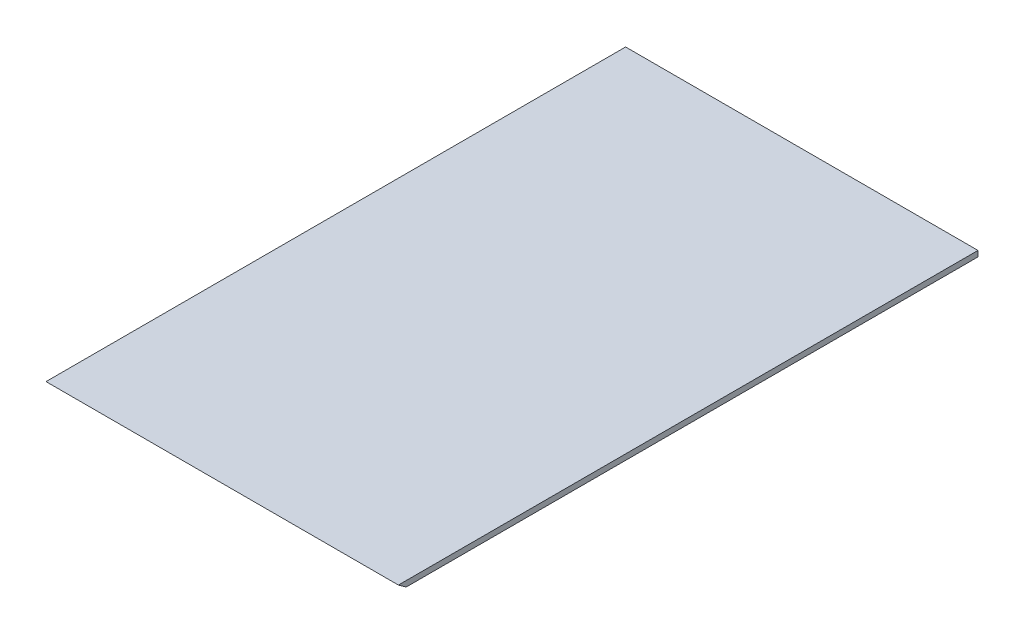
ISO-10303-21;
HEADER;
FILE_DESCRIPTION(('STEP AP214'),'2;1');
FILE_NAME('part.step','',(''),(''),'','','');
FILE_SCHEMA(('AUTOMOTIVE_DESIGN { 1 0 10303 214 1 1 1 1 }'));
ENDSEC;
DATA;
#1=APPLICATION_CONTEXT('core data for automotive mechanical design processes');
#2=APPLICATION_PROTOCOL_DEFINITION('international standard','automotive_design',2000,#1);
#3=PRODUCT_CONTEXT('',#1,'mechanical');
#4=PRODUCT('Part','Part','',(#3));
#5=PRODUCT_RELATED_PRODUCT_CATEGORY('part','',(#4));
#6=PRODUCT_DEFINITION_FORMATION('','',#4);
#7=PRODUCT_DEFINITION_CONTEXT('part definition',#1,'design');
#8=PRODUCT_DEFINITION('design','',#6,#7);
#9=PRODUCT_DEFINITION_SHAPE('','',#8);
#10=(LENGTH_UNIT() NAMED_UNIT(*) SI_UNIT(.MILLI.,.METRE.));
#11=(NAMED_UNIT(*) PLANE_ANGLE_UNIT() SI_UNIT($,.RADIAN.));
#12=(NAMED_UNIT(*) SI_UNIT($,.STERADIAN.) SOLID_ANGLE_UNIT());
#13=UNCERTAINTY_MEASURE_WITH_UNIT(LENGTH_MEASURE(1.E-05),#10,'distance_accuracy_value','');
#14=(GEOMETRIC_REPRESENTATION_CONTEXT(3) GLOBAL_UNCERTAINTY_ASSIGNED_CONTEXT((#13)) GLOBAL_UNIT_ASSIGNED_CONTEXT((#10,
#11,#12)) REPRESENTATION_CONTEXT('',''));
#15=CARTESIAN_POINT('',(0.,0.,0.));
#16=DIRECTION('',(0.,0.,1.));
#17=DIRECTION('',(1.,0.,0.));
#18=AXIS2_PLACEMENT_3D('',#15,#16,#17);
#19=CARTESIAN_POINT('',(0.,0.,331.679162275034));
#20=DIRECTION('',(0.,0.,-1.));
#21=DIRECTION('',(-1.,0.,0.));
#22=AXIS2_PLACEMENT_3D('',#19,#20,#21);
#23=PLANE('',#22);
#24=DIRECTION('',(0.,1.,0.));
#25=VECTOR('',#24,1.);
#26=CARTESIAN_POINT('',(119.32984659125,261.845661589939,331.679162275034));
#27=LINE('',#26,#25);
#28=CARTESIAN_POINT('',(119.32984659125,258.84566158994,331.679162275034));
#29=VERTEX_POINT('',#28);
#30=CARTESIAN_POINT('',(119.32984659125,261.845661589939,331.679162275034));
#31=VERTEX_POINT('',#30);
#32=EDGE_CURVE('E83',#29,#31,#27,.T.);
#33=ORIENTED_EDGE('',*,*,#32,.F.);
#34=DIRECTION('',(1.,0.,0.));
#35=VECTOR('',#34,1.);
#36=CARTESIAN_POINT('',(119.32984659125,258.84566158994,331.679162275034));
#37=LINE('',#36,#35);
#38=CARTESIAN_POINT('',(-68.1701534087503,258.84566158994,331.679162275034));
#39=VERTEX_POINT('',#38);
#40=EDGE_CURVE('E94',#39,#29,#37,.T.);
#41=ORIENTED_EDGE('',*,*,#40,.F.);
#42=DIRECTION('',(0.,-1.,0.));
#43=VECTOR('',#42,1.);
#44=CARTESIAN_POINT('',(-68.1701534087503,261.845661589939,331.679162275034));
#45=LINE('',#44,#43);
#46=CARTESIAN_POINT('',(-68.1701534087503,261.845661589939,331.679162275034));
#47=VERTEX_POINT('',#46);
#48=EDGE_CURVE('E85',#47,#39,#45,.T.);
#49=ORIENTED_EDGE('',*,*,#48,.F.);
#50=DIRECTION('',(-1.,0.,0.));
#51=VECTOR('',#50,1.);
#52=CARTESIAN_POINT('',(119.32984659125,261.845661589939,331.679162275034));
#53=LINE('',#52,#51);
#54=EDGE_CURVE('E75',#31,#47,#53,.T.);
#55=ORIENTED_EDGE('',*,*,#54,.F.);
#56=EDGE_LOOP('',(#33,#41,#49,#55));
#57=FACE_BOUND('',#56,.T.);
#58=ADVANCED_FACE('F33',(#57),#23,.T.);
#59=CARTESIAN_POINT('',(119.32984659125,258.84566158994,892.36319217791));
#60=DIRECTION('',(0.,1.,0.));
#61=DIRECTION('',(0.,0.,1.));
#62=AXIS2_PLACEMENT_3D('',#59,#60,#61);
#63=PLANE('',#62);
#64=DIRECTION('',(0.,0.,-1.));
#65=VECTOR('',#64,1.);
#66=CARTESIAN_POINT('',(119.32984659125,258.84566158994,892.36319217791));
#67=LINE('',#66,#65);
#68=CARTESIAN_POINT('',(119.32984659125,258.84566158994,635.901725400392));
#69=VERTEX_POINT('',#68);
#70=EDGE_CURVE('E88',#69,#29,#67,.T.);
#71=ORIENTED_EDGE('',*,*,#70,.F.);
#72=DIRECTION('',(-1.,0.,0.));
#73=VECTOR('',#72,1.);
#74=CARTESIAN_POINT('',(119.32984659125,258.84566158994,635.901725400392));
#75=LINE('',#74,#73);
#76=CARTESIAN_POINT('',(-68.1701534087503,258.84566158994,635.901725400392));
#77=VERTEX_POINT('',#76);
#78=EDGE_CURVE('E37',#69,#77,#75,.T.);
#79=ORIENTED_EDGE('',*,*,#78,.T.);
#80=DIRECTION('',(0.,0.,-1.));
#81=VECTOR('',#80,1.);
#82=CARTESIAN_POINT('',(-68.1701534087503,258.84566158994,892.36319217791));
#83=LINE('',#82,#81);
#84=EDGE_CURVE('E97',#77,#39,#83,.T.);
#85=ORIENTED_EDGE('',*,*,#84,.T.);
#86=ORIENTED_EDGE('',*,*,#40,.T.);
#87=EDGE_LOOP('',(#71,#79,#85,#86));
#88=FACE_BOUND('',#87,.T.);
#89=ADVANCED_FACE('F106',(#88),#63,.F.);
#90=CARTESIAN_POINT('',(-68.1701534087503,261.845661589939,892.36319217791));
#91=DIRECTION('',(1.,0.,0.));
#92=DIRECTION('',(0.,0.,-1.));
#93=AXIS2_PLACEMENT_3D('',#90,#91,#92);
#94=PLANE('',#93);
#95=ORIENTED_EDGE('',*,*,#84,.F.);
#96=DIRECTION('',(0.,0.583774943754806,0.811915522110566));
#97=VECTOR('',#96,1.);
#98=CARTESIAN_POINT('',(-68.1701534087503,381.424605486614,806.384799911092));
#99=LINE('',#98,#97);
#100=CARTESIAN_POINT('',(-68.1701534087503,261.845661589939,640.074132236946));
#101=VERTEX_POINT('',#100);
#102=EDGE_CURVE('E103',#77,#101,#99,.T.);
#103=ORIENTED_EDGE('',*,*,#102,.T.);
#104=DIRECTION('',(0.,0.,-1.));
#105=VECTOR('',#104,1.);
#106=CARTESIAN_POINT('',(-68.1701534087503,261.845661589939,892.36319217791));
#107=LINE('',#106,#105);
#108=EDGE_CURVE('E79',#101,#47,#107,.T.);
#109=ORIENTED_EDGE('',*,*,#108,.T.);
#110=ORIENTED_EDGE('',*,*,#48,.T.);
#111=EDGE_LOOP('',(#95,#103,#109,#110));
#112=FACE_BOUND('',#111,.T.);
#113=ADVANCED_FACE('F102',(#112),#94,.F.);
#114=CARTESIAN_POINT('',(119.32984659125,261.845661589939,892.36319217791));
#115=DIRECTION('',(0.,-1.,0.));
#116=DIRECTION('',(0.,0.,-1.));
#117=AXIS2_PLACEMENT_3D('',#114,#115,#116);
#118=PLANE('',#117);
#119=ORIENTED_EDGE('',*,*,#108,.F.);
#120=DIRECTION('',(1.,0.,0.));
#121=VECTOR('',#120,1.);
#122=CARTESIAN_POINT('',(119.32984659125,261.845661589939,640.074132236946));
#123=LINE('',#122,#121);
#124=CARTESIAN_POINT('',(119.32984659125,261.845661589939,640.074132236946));
#125=VERTEX_POINT('',#124);
#126=EDGE_CURVE('E42',#101,#125,#123,.T.);
#127=ORIENTED_EDGE('',*,*,#126,.T.);
#128=DIRECTION('',(0.,0.,-1.));
#129=VECTOR('',#128,1.);
#130=CARTESIAN_POINT('',(119.32984659125,261.845661589939,892.36319217791));
#131=LINE('',#130,#129);
#132=EDGE_CURVE('E72',#125,#31,#131,.T.);
#133=ORIENTED_EDGE('',*,*,#132,.T.);
#134=ORIENTED_EDGE('',*,*,#54,.T.);
#135=EDGE_LOOP('',(#119,#127,#133,#134));
#136=FACE_BOUND('',#135,.T.);
#137=ADVANCED_FACE('F74',(#136),#118,.F.);
#138=CARTESIAN_POINT('',(119.32984659125,261.845661589939,892.36319217791));
#139=DIRECTION('',(-1.,0.,0.));
#140=DIRECTION('',(0.,0.,1.));
#141=AXIS2_PLACEMENT_3D('',#138,#139,#140);
#142=PLANE('',#141);
#143=ORIENTED_EDGE('',*,*,#132,.F.);
#144=DIRECTION('',(0.,-0.583774943754806,-0.811915522110566));
#145=VECTOR('',#144,1.);
#146=CARTESIAN_POINT('',(119.32984659125,381.424605486614,806.384799911092));
#147=LINE('',#146,#145);
#148=EDGE_CURVE('E11',#125,#69,#147,.T.);
#149=ORIENTED_EDGE('',*,*,#148,.T.);
#150=ORIENTED_EDGE('',*,*,#70,.T.);
#151=ORIENTED_EDGE('',*,*,#32,.T.);
#152=EDGE_LOOP('',(#143,#149,#150,#151));
#153=FACE_BOUND('',#152,.T.);
#154=ADVANCED_FACE('F35',(#153),#142,.F.);
#155=CARTESIAN_POINT('',(7158.63100095519,483.261300627783,948.019507584129));
#156=DIRECTION('',(0.,0.811915522110566,-0.583774943754806));
#157=DIRECTION('',(0.,0.583774943754806,0.811915522110566));
#158=AXIS2_PLACEMENT_3D('',#155,#156,#157);
#159=PLANE('',#158);
#160=ORIENTED_EDGE('',*,*,#126,.F.);
#161=ORIENTED_EDGE('',*,*,#102,.F.);
#162=ORIENTED_EDGE('',*,*,#78,.F.);
#163=ORIENTED_EDGE('',*,*,#148,.F.);
#164=EDGE_LOOP('',(#160,#161,#162,#163));
#165=FACE_BOUND('',#164,.T.);
#166=ADVANCED_FACE('F120',(#165),#159,.F.);
#167=CLOSED_SHELL('',(#58,#89,#113,#137,#154,#166));
#168=MANIFOLD_SOLID_BREP('B2',#167);
#169=ADVANCED_BREP_SHAPE_REPRESENTATION('',(#18,#168),#14);
#170=SHAPE_DEFINITION_REPRESENTATION(#9,#169);
ENDSEC;
END-ISO-10303-21;
